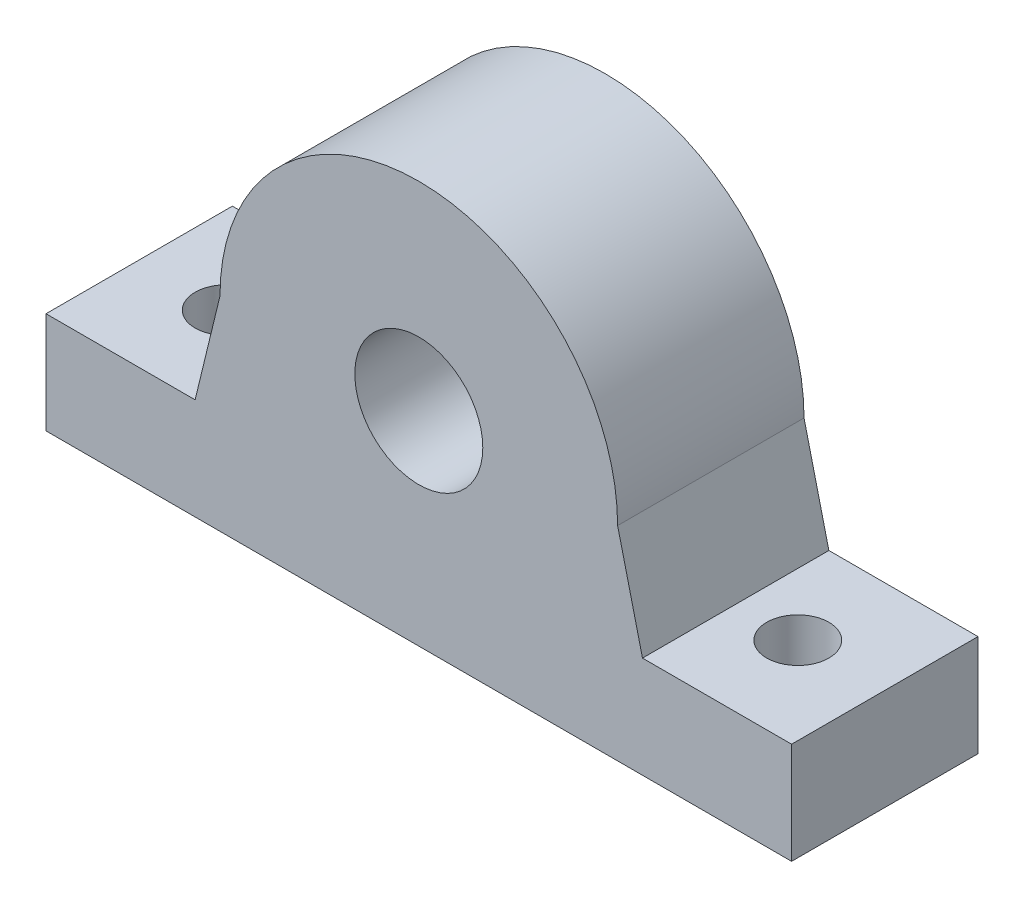
ISO-10303-21;
HEADER;
FILE_DESCRIPTION(('STEP AP214'),'2;1');
FILE_NAME('part.step','',(''),(''),'','','');
FILE_SCHEMA(('AUTOMOTIVE_DESIGN { 1 0 10303 214 1 1 1 1 }'));
ENDSEC;
DATA;
#1=APPLICATION_CONTEXT('core data for automotive mechanical design processes');
#2=APPLICATION_PROTOCOL_DEFINITION('international standard','automotive_design',2000,#1);
#3=PRODUCT_CONTEXT('',#1,'mechanical');
#4=PRODUCT('Part','Part','',(#3));
#5=PRODUCT_RELATED_PRODUCT_CATEGORY('part','',(#4));
#6=PRODUCT_DEFINITION_FORMATION('','',#4);
#7=PRODUCT_DEFINITION_CONTEXT('part definition',#1,'design');
#8=PRODUCT_DEFINITION('design','',#6,#7);
#9=PRODUCT_DEFINITION_SHAPE('','',#8);
#10=(LENGTH_UNIT() NAMED_UNIT(*) SI_UNIT(.MILLI.,.METRE.));
#11=(NAMED_UNIT(*) PLANE_ANGLE_UNIT() SI_UNIT($,.RADIAN.));
#12=(NAMED_UNIT(*) SI_UNIT($,.STERADIAN.) SOLID_ANGLE_UNIT());
#13=UNCERTAINTY_MEASURE_WITH_UNIT(LENGTH_MEASURE(1.E-05),#10,'distance_accuracy_value','');
#14=(GEOMETRIC_REPRESENTATION_CONTEXT(3) GLOBAL_UNCERTAINTY_ASSIGNED_CONTEXT((#13)) GLOBAL_UNIT_ASSIGNED_CONTEXT((#10,
#11,#12)) REPRESENTATION_CONTEXT('',''));
#15=CARTESIAN_POINT('',(0.,0.,0.));
#16=DIRECTION('',(0.,0.,1.));
#17=DIRECTION('',(1.,0.,0.));
#18=AXIS2_PLACEMENT_3D('',#15,#16,#17);
#19=CARTESIAN_POINT('',(0.,0.,15.));
#20=DIRECTION('',(0.,0.,-1.));
#21=DIRECTION('',(-1.,0.,0.));
#22=AXIS2_PLACEMENT_3D('',#19,#20,#21);
#23=PLANE('',#22);
#24=CARTESIAN_POINT('',(0.,0.,15.));
#25=DIRECTION('',(0.,0.,1.));
#26=DIRECTION('',(-1.,0.,0.));
#27=AXIS2_PLACEMENT_3D('',#24,#25,#26);
#28=CIRCLE('',#27,16.);
#29=CARTESIAN_POINT('',(16.,0.,15.));
#30=VERTEX_POINT('',#29);
#31=CARTESIAN_POINT('',(-16.,0.,15.));
#32=VERTEX_POINT('',#31);
#33=EDGE_CURVE('E150',#30,#32,#28,.T.);
#34=ORIENTED_EDGE('',*,*,#33,.T.);
#35=DIRECTION('',(-0.236019714905749,-0.971748266875639,0.));
#36=VECTOR('',#35,1.);
#37=CARTESIAN_POINT('',(-16.,0.,15.));
#38=LINE('',#37,#36);
#39=CARTESIAN_POINT('',(-18.,-8.23446691530569,15.));
#40=VERTEX_POINT('',#39);
#41=EDGE_CURVE('E98',#32,#40,#38,.T.);
#42=ORIENTED_EDGE('',*,*,#41,.T.);
#43=DIRECTION('',(-1.,0.,0.));
#44=VECTOR('',#43,1.);
#45=CARTESIAN_POINT('',(-18.,-8.23446691530569,15.));
#46=LINE('',#45,#44);
#47=CARTESIAN_POINT('',(-30.,-8.23446691530569,15.));
#48=VERTEX_POINT('',#47);
#49=EDGE_CURVE('E166',#40,#48,#46,.T.);
#50=ORIENTED_EDGE('',*,*,#49,.T.);
#51=DIRECTION('',(0.,-1.,0.));
#52=VECTOR('',#51,1.);
#53=CARTESIAN_POINT('',(-30.,-8.23446691530569,15.));
#54=LINE('',#53,#52);
#55=CARTESIAN_POINT('',(-30.,-16.4,15.));
#56=VERTEX_POINT('',#55);
#57=EDGE_CURVE('E178',#48,#56,#54,.T.);
#58=ORIENTED_EDGE('',*,*,#57,.T.);
#59=DIRECTION('',(1.,0.,0.));
#60=VECTOR('',#59,1.);
#61=CARTESIAN_POINT('',(-30.,-16.4,15.));
#62=LINE('',#61,#60);
#63=CARTESIAN_POINT('',(30.,-16.4,15.));
#64=VERTEX_POINT('',#63);
#65=EDGE_CURVE('E117',#56,#64,#62,.T.);
#66=ORIENTED_EDGE('',*,*,#65,.T.);
#67=DIRECTION('',(0.,1.,0.));
#68=VECTOR('',#67,1.);
#69=CARTESIAN_POINT('',(30.,-8.23446691530568,15.));
#70=LINE('',#69,#68);
#71=CARTESIAN_POINT('',(30.,-8.23446691530568,15.));
#72=VERTEX_POINT('',#71);
#73=EDGE_CURVE('E111',#64,#72,#70,.T.);
#74=ORIENTED_EDGE('',*,*,#73,.T.);
#75=DIRECTION('',(-1.,0.,0.));
#76=VECTOR('',#75,1.);
#77=CARTESIAN_POINT('',(18.,-8.23446691530568,15.));
#78=LINE('',#77,#76);
#79=CARTESIAN_POINT('',(18.,-8.23446691530568,15.));
#80=VERTEX_POINT('',#79);
#81=EDGE_CURVE('E115',#72,#80,#78,.T.);
#82=ORIENTED_EDGE('',*,*,#81,.T.);
#83=DIRECTION('',(-0.23601971490575,0.971748266875639,0.));
#84=VECTOR('',#83,1.);
#85=CARTESIAN_POINT('',(16.,0.,15.));
#86=LINE('',#85,#84);
#87=EDGE_CURVE('E55',#80,#30,#86,.T.);
#88=ORIENTED_EDGE('',*,*,#87,.T.);
#89=EDGE_LOOP('',(#34,#42,#50,#58,#66,#74,#82,#88));
#90=FACE_BOUND('',#89,.T.);
#91=CARTESIAN_POINT('',(0.,0.,15.));
#92=DIRECTION('',(0.,0.,1.));
#93=DIRECTION('',(1.,0.,0.));
#94=AXIS2_PLACEMENT_3D('',#91,#92,#93);
#95=CIRCLE('',#94,5.15);
#96=CARTESIAN_POINT('',(5.15,0.,15.));
#97=VERTEX_POINT('',#96);
#98=EDGE_CURVE('E139',#97,#97,#95,.T.);
#99=ORIENTED_EDGE('',*,*,#98,.F.);
#100=EDGE_LOOP('',(#99));
#101=FACE_BOUND('',#100,.T.);
#102=ADVANCED_FACE('F37',(#90,#101),#23,.F.);
#103=CARTESIAN_POINT('',(0.,0.,0.));
#104=DIRECTION('',(0.,0.,-1.));
#105=DIRECTION('',(-1.,0.,0.));
#106=AXIS2_PLACEMENT_3D('',#103,#104,#105);
#107=PLANE('',#106);
#108=CARTESIAN_POINT('',(0.,0.,0.));
#109=DIRECTION('',(0.,0.,1.));
#110=DIRECTION('',(1.,0.,0.));
#111=AXIS2_PLACEMENT_3D('',#108,#109,#110);
#112=CIRCLE('',#111,11.);
#113=CARTESIAN_POINT('',(11.,0.,0.));
#114=VERTEX_POINT('',#113);
#115=EDGE_CURVE('E186',#114,#114,#112,.T.);
#116=ORIENTED_EDGE('',*,*,#115,.T.);
#117=EDGE_LOOP('',(#116));
#118=FACE_BOUND('',#117,.T.);
#119=CARTESIAN_POINT('',(0.,0.,0.));
#120=DIRECTION('',(0.,0.,1.));
#121=DIRECTION('',(-1.,0.,0.));
#122=AXIS2_PLACEMENT_3D('',#119,#120,#121);
#123=CIRCLE('',#122,16.);
#124=CARTESIAN_POINT('',(16.,0.,0.));
#125=VERTEX_POINT('',#124);
#126=CARTESIAN_POINT('',(-16.,0.,0.));
#127=VERTEX_POINT('',#126);
#128=EDGE_CURVE('E135',#125,#127,#123,.T.);
#129=ORIENTED_EDGE('',*,*,#128,.F.);
#130=DIRECTION('',(-0.23601971490575,0.971748266875639,0.));
#131=VECTOR('',#130,1.);
#132=CARTESIAN_POINT('',(16.,0.,0.));
#133=LINE('',#132,#131);
#134=CARTESIAN_POINT('',(18.,-8.23446691530568,0.));
#135=VERTEX_POINT('',#134);
#136=EDGE_CURVE('E90',#135,#125,#133,.T.);
#137=ORIENTED_EDGE('',*,*,#136,.F.);
#138=DIRECTION('',(-1.,0.,0.));
#139=VECTOR('',#138,1.);
#140=CARTESIAN_POINT('',(18.,-8.23446691530568,0.));
#141=LINE('',#140,#139);
#142=CARTESIAN_POINT('',(30.,-8.23446691530568,0.));
#143=VERTEX_POINT('',#142);
#144=EDGE_CURVE('E84',#143,#135,#141,.T.);
#145=ORIENTED_EDGE('',*,*,#144,.F.);
#146=DIRECTION('',(0.,1.,0.));
#147=VECTOR('',#146,1.);
#148=CARTESIAN_POINT('',(30.,-8.23446691530568,0.));
#149=LINE('',#148,#147);
#150=CARTESIAN_POINT('',(30.,-16.4,0.));
#151=VERTEX_POINT('',#150);
#152=EDGE_CURVE('E125',#151,#143,#149,.T.);
#153=ORIENTED_EDGE('',*,*,#152,.F.);
#154=DIRECTION('',(1.,0.,0.));
#155=VECTOR('',#154,1.);
#156=CARTESIAN_POINT('',(-30.,-16.4,0.));
#157=LINE('',#156,#155);
#158=CARTESIAN_POINT('',(-30.,-16.4,0.));
#159=VERTEX_POINT('',#158);
#160=EDGE_CURVE('E145',#159,#151,#157,.T.);
#161=ORIENTED_EDGE('',*,*,#160,.F.);
#162=DIRECTION('',(0.,-1.,0.));
#163=VECTOR('',#162,1.);
#164=CARTESIAN_POINT('',(-30.,-8.23446691530569,0.));
#165=LINE('',#164,#163);
#166=CARTESIAN_POINT('',(-30.,-8.23446691530569,0.));
#167=VERTEX_POINT('',#166);
#168=EDGE_CURVE('E143',#167,#159,#165,.T.);
#169=ORIENTED_EDGE('',*,*,#168,.F.);
#170=DIRECTION('',(-1.,0.,0.));
#171=VECTOR('',#170,1.);
#172=CARTESIAN_POINT('',(-18.,-8.23446691530569,0.));
#173=LINE('',#172,#171);
#174=CARTESIAN_POINT('',(-18.,-8.23446691530569,0.));
#175=VERTEX_POINT('',#174);
#176=EDGE_CURVE('E141',#175,#167,#173,.T.);
#177=ORIENTED_EDGE('',*,*,#176,.F.);
#178=DIRECTION('',(-0.236019714905749,-0.971748266875639,0.));
#179=VECTOR('',#178,1.);
#180=CARTESIAN_POINT('',(-16.,0.,0.));
#181=LINE('',#180,#179);
#182=EDGE_CURVE('E138',#127,#175,#181,.T.);
#183=ORIENTED_EDGE('',*,*,#182,.F.);
#184=EDGE_LOOP('',(#129,#137,#145,#153,#161,#169,#177,#183));
#185=FACE_BOUND('',#184,.T.);
#186=ADVANCED_FACE('F170',(#118,#185),#107,.T.);
#187=CARTESIAN_POINT('',(0.,0.,15.));
#188=DIRECTION('',(0.,0.,-1.));
#189=DIRECTION('',(-1.,0.,0.));
#190=AXIS2_PLACEMENT_3D('',#187,#188,#189);
#191=CYLINDRICAL_SURFACE('',#190,16.);
#192=ORIENTED_EDGE('',*,*,#128,.T.);
#193=DIRECTION('',(0.,0.,-1.));
#194=VECTOR('',#193,1.);
#195=CARTESIAN_POINT('',(-16.,0.,15.));
#196=LINE('',#195,#194);
#197=EDGE_CURVE('E11',#32,#127,#196,.T.);
#198=ORIENTED_EDGE('',*,*,#197,.F.);
#199=ORIENTED_EDGE('',*,*,#33,.F.);
#200=DIRECTION('',(0.,0.,-1.));
#201=VECTOR('',#200,1.);
#202=CARTESIAN_POINT('',(16.,0.,15.));
#203=LINE('',#202,#201);
#204=EDGE_CURVE('E131',#30,#125,#203,.T.);
#205=ORIENTED_EDGE('',*,*,#204,.T.);
#206=EDGE_LOOP('',(#192,#198,#199,#205));
#207=FACE_BOUND('',#206,.T.);
#208=ADVANCED_FACE('F39',(#207),#191,.T.);
#209=CARTESIAN_POINT('',(-16.,0.,15.));
#210=DIRECTION('',(0.971748266875639,-0.236019714905749,0.));
#211=DIRECTION('',(0.236019714905749,0.971748266875639,0.));
#212=AXIS2_PLACEMENT_3D('',#209,#210,#211);
#213=PLANE('',#212);
#214=ORIENTED_EDGE('',*,*,#182,.T.);
#215=DIRECTION('',(0.,0.,-1.));
#216=VECTOR('',#215,1.);
#217=CARTESIAN_POINT('',(-18.,-8.23446691530569,15.));
#218=LINE('',#217,#216);
#219=EDGE_CURVE('E47',#40,#175,#218,.T.);
#220=ORIENTED_EDGE('',*,*,#219,.F.);
#221=ORIENTED_EDGE('',*,*,#41,.F.);
#222=ORIENTED_EDGE('',*,*,#197,.T.);
#223=EDGE_LOOP('',(#214,#220,#221,#222));
#224=FACE_BOUND('',#223,.T.);
#225=ADVANCED_FACE('F215',(#224),#213,.F.);
#226=CARTESIAN_POINT('',(-18.,-8.23446691530569,15.));
#227=DIRECTION('',(0.,-1.,0.));
#228=DIRECTION('',(0.,0.,-1.));
#229=AXIS2_PLACEMENT_3D('',#226,#227,#228);
#230=PLANE('',#229);
#231=CARTESIAN_POINT('',(-23.,-8.23446691530569,7.5));
#232=DIRECTION('',(0.,1.,0.));
#233=DIRECTION('',(-1.,0.,0.));
#234=AXIS2_PLACEMENT_3D('',#231,#232,#233);
#235=CIRCLE('',#234,2.5);
#236=CARTESIAN_POINT('',(-25.5,-8.23446691530569,7.5));
#237=VERTEX_POINT('',#236);
#238=EDGE_CURVE('E199',#237,#237,#235,.T.);
#239=ORIENTED_EDGE('',*,*,#238,.F.);
#240=EDGE_LOOP('',(#239));
#241=FACE_BOUND('',#240,.T.);
#242=ORIENTED_EDGE('',*,*,#176,.T.);
#243=DIRECTION('',(0.,0.,-1.));
#244=VECTOR('',#243,1.);
#245=CARTESIAN_POINT('',(-30.,-8.23446691530569,15.));
#246=LINE('',#245,#244);
#247=EDGE_CURVE('E157',#48,#167,#246,.T.);
#248=ORIENTED_EDGE('',*,*,#247,.F.);
#249=ORIENTED_EDGE('',*,*,#49,.F.);
#250=ORIENTED_EDGE('',*,*,#219,.T.);
#251=EDGE_LOOP('',(#242,#248,#249,#250));
#252=FACE_BOUND('',#251,.T.);
#253=ADVANCED_FACE('F164',(#241,#252),#230,.F.);
#254=CARTESIAN_POINT('',(-30.,-8.23446691530569,15.));
#255=DIRECTION('',(1.,0.,0.));
#256=DIRECTION('',(0.,1.,0.));
#257=AXIS2_PLACEMENT_3D('',#254,#255,#256);
#258=PLANE('',#257);
#259=ORIENTED_EDGE('',*,*,#168,.T.);
#260=DIRECTION('',(0.,0.,-1.));
#261=VECTOR('',#260,1.);
#262=CARTESIAN_POINT('',(-30.,-16.4,15.));
#263=LINE('',#262,#261);
#264=EDGE_CURVE('E154',#56,#159,#263,.T.);
#265=ORIENTED_EDGE('',*,*,#264,.F.);
#266=ORIENTED_EDGE('',*,*,#57,.F.);
#267=ORIENTED_EDGE('',*,*,#247,.T.);
#268=EDGE_LOOP('',(#259,#265,#266,#267));
#269=FACE_BOUND('',#268,.T.);
#270=ADVANCED_FACE('F174',(#269),#258,.F.);
#271=CARTESIAN_POINT('',(-30.,-16.4,15.));
#272=DIRECTION('',(0.,1.,0.));
#273=DIRECTION('',(-1.,0.,0.));
#274=AXIS2_PLACEMENT_3D('',#271,#272,#273);
#275=PLANE('',#274);
#276=CARTESIAN_POINT('',(-23.,-16.4,7.5));
#277=DIRECTION('',(0.,1.,0.));
#278=DIRECTION('',(-1.,0.,0.));
#279=AXIS2_PLACEMENT_3D('',#276,#277,#278);
#280=CIRCLE('',#279,2.5);
#281=CARTESIAN_POINT('',(-25.5,-16.4,7.5));
#282=VERTEX_POINT('',#281);
#283=EDGE_CURVE('E190',#282,#282,#280,.T.);
#284=ORIENTED_EDGE('',*,*,#283,.T.);
#285=EDGE_LOOP('',(#284));
#286=FACE_BOUND('',#285,.T.);
#287=CARTESIAN_POINT('',(23.,-16.4,7.49999999999999));
#288=DIRECTION('',(0.,1.,0.));
#289=DIRECTION('',(1.,0.,0.));
#290=AXIS2_PLACEMENT_3D('',#287,#288,#289);
#291=CIRCLE('',#290,2.5);
#292=CARTESIAN_POINT('',(25.5,-16.4,7.49999999999999));
#293=VERTEX_POINT('',#292);
#294=EDGE_CURVE('E196',#293,#293,#291,.T.);
#295=ORIENTED_EDGE('',*,*,#294,.T.);
#296=EDGE_LOOP('',(#295));
#297=FACE_BOUND('',#296,.T.);
#298=ORIENTED_EDGE('',*,*,#160,.T.);
#299=DIRECTION('',(0.,0.,-1.));
#300=VECTOR('',#299,1.);
#301=CARTESIAN_POINT('',(30.,-16.4,15.));
#302=LINE('',#301,#300);
#303=EDGE_CURVE('E126',#64,#151,#302,.T.);
#304=ORIENTED_EDGE('',*,*,#303,.F.);
#305=ORIENTED_EDGE('',*,*,#65,.F.);
#306=ORIENTED_EDGE('',*,*,#264,.T.);
#307=EDGE_LOOP('',(#298,#304,#305,#306));
#308=FACE_BOUND('',#307,.T.);
#309=ADVANCED_FACE('F177',(#286,#297,#308),#275,.F.);
#310=CARTESIAN_POINT('',(30.,-8.23446691530568,15.));
#311=DIRECTION('',(-1.,0.,0.));
#312=DIRECTION('',(0.,-1.,0.));
#313=AXIS2_PLACEMENT_3D('',#310,#311,#312);
#314=PLANE('',#313);
#315=ORIENTED_EDGE('',*,*,#152,.T.);
#316=DIRECTION('',(0.,0.,-1.));
#317=VECTOR('',#316,1.);
#318=CARTESIAN_POINT('',(30.,-8.23446691530568,15.));
#319=LINE('',#318,#317);
#320=EDGE_CURVE('E122',#72,#143,#319,.T.);
#321=ORIENTED_EDGE('',*,*,#320,.F.);
#322=ORIENTED_EDGE('',*,*,#73,.F.);
#323=ORIENTED_EDGE('',*,*,#303,.T.);
#324=EDGE_LOOP('',(#315,#321,#322,#323));
#325=FACE_BOUND('',#324,.T.);
#326=ADVANCED_FACE('F123',(#325),#314,.F.);
#327=CARTESIAN_POINT('',(18.,-8.23446691530568,15.));
#328=DIRECTION('',(0.,-1.,0.));
#329=DIRECTION('',(1.,0.,0.));
#330=AXIS2_PLACEMENT_3D('',#327,#328,#329);
#331=PLANE('',#330);
#332=CARTESIAN_POINT('',(23.,-8.23446691530568,7.49999999999999));
#333=DIRECTION('',(0.,1.,0.));
#334=DIRECTION('',(1.,0.,0.));
#335=AXIS2_PLACEMENT_3D('',#332,#333,#334);
#336=CIRCLE('',#335,2.5);
#337=CARTESIAN_POINT('',(25.5,-8.23446691530568,7.49999999999999));
#338=VERTEX_POINT('',#337);
#339=EDGE_CURVE('E193',#338,#338,#336,.T.);
#340=ORIENTED_EDGE('',*,*,#339,.F.);
#341=EDGE_LOOP('',(#340));
#342=FACE_BOUND('',#341,.T.);
#343=ORIENTED_EDGE('',*,*,#144,.T.);
#344=DIRECTION('',(0.,0.,-1.));
#345=VECTOR('',#344,1.);
#346=CARTESIAN_POINT('',(18.,-8.23446691530568,15.));
#347=LINE('',#346,#345);
#348=EDGE_CURVE('E127',#80,#135,#347,.T.);
#349=ORIENTED_EDGE('',*,*,#348,.F.);
#350=ORIENTED_EDGE('',*,*,#81,.F.);
#351=ORIENTED_EDGE('',*,*,#320,.T.);
#352=EDGE_LOOP('',(#343,#349,#350,#351));
#353=FACE_BOUND('',#352,.T.);
#354=ADVANCED_FACE('F129',(#342,#353),#331,.F.);
#355=CARTESIAN_POINT('',(16.,0.,15.));
#356=DIRECTION('',(-0.971748266875639,-0.23601971490575,0.));
#357=DIRECTION('',(0.23601971490575,-0.971748266875639,0.));
#358=AXIS2_PLACEMENT_3D('',#355,#356,#357);
#359=PLANE('',#358);
#360=ORIENTED_EDGE('',*,*,#136,.T.);
#361=ORIENTED_EDGE('',*,*,#204,.F.);
#362=ORIENTED_EDGE('',*,*,#87,.F.);
#363=ORIENTED_EDGE('',*,*,#348,.T.);
#364=EDGE_LOOP('',(#360,#361,#362,#363));
#365=FACE_BOUND('',#364,.T.);
#366=ADVANCED_FACE('F233',(#365),#359,.F.);
#367=CARTESIAN_POINT('',(0.,0.,15.));
#368=DIRECTION('',(0.,0.,-1.));
#369=DIRECTION('',(-1.,0.,0.));
#370=AXIS2_PLACEMENT_3D('',#367,#368,#369);
#371=CYLINDRICAL_SURFACE('',#370,5.15);
#372=CARTESIAN_POINT('',(0.,0.,4.));
#373=DIRECTION('',(0.,0.,1.));
#374=DIRECTION('',(1.,0.,0.));
#375=AXIS2_PLACEMENT_3D('',#372,#373,#374);
#376=CIRCLE('',#375,5.15);
#377=CARTESIAN_POINT('',(5.15,0.,4.));
#378=VERTEX_POINT('',#377);
#379=EDGE_CURVE('E41',#378,#378,#376,.T.);
#380=ORIENTED_EDGE('',*,*,#379,.F.);
#381=EDGE_LOOP('',(#380));
#382=FACE_BOUND('',#381,.T.);
#383=ORIENTED_EDGE('',*,*,#98,.T.);
#384=EDGE_LOOP('',(#383));
#385=FACE_BOUND('',#384,.T.);
#386=ADVANCED_FACE('F230',(#382,#385),#371,.F.);
#387=CARTESIAN_POINT('',(0.,0.,4.));
#388=DIRECTION('',(0.,0.,-1.));
#389=DIRECTION('',(-1.,0.,0.));
#390=AXIS2_PLACEMENT_3D('',#387,#388,#389);
#391=CYLINDRICAL_SURFACE('',#390,11.);
#392=CARTESIAN_POINT('',(0.,0.,4.));
#393=DIRECTION('',(0.,0.,1.));
#394=DIRECTION('',(1.,0.,0.));
#395=AXIS2_PLACEMENT_3D('',#392,#393,#394);
#396=CIRCLE('',#395,11.);
#397=CARTESIAN_POINT('',(11.,0.,4.));
#398=VERTEX_POINT('',#397);
#399=EDGE_CURVE('E189',#398,#398,#396,.T.);
#400=ORIENTED_EDGE('',*,*,#399,.T.);
#401=EDGE_LOOP('',(#400));
#402=FACE_BOUND('',#401,.T.);
#403=ORIENTED_EDGE('',*,*,#115,.F.);
#404=EDGE_LOOP('',(#403));
#405=FACE_BOUND('',#404,.T.);
#406=ADVANCED_FACE('F266',(#402,#405),#391,.F.);
#407=CARTESIAN_POINT('',(0.,0.,4.));
#408=DIRECTION('',(0.,0.,1.));
#409=DIRECTION('',(1.,0.,0.));
#410=AXIS2_PLACEMENT_3D('',#407,#408,#409);
#411=PLANE('',#410);
#412=ORIENTED_EDGE('',*,*,#379,.T.);
#413=EDGE_LOOP('',(#412));
#414=FACE_BOUND('',#413,.T.);
#415=ORIENTED_EDGE('',*,*,#399,.F.);
#416=EDGE_LOOP('',(#415));
#417=FACE_BOUND('',#416,.T.);
#418=ADVANCED_FACE('F273',(#414,#417),#411,.F.);
#419=CARTESIAN_POINT('',(23.,-16.4,7.49999999999999));
#420=DIRECTION('',(0.,1.,0.));
#421=DIRECTION('',(-1.,0.,0.));
#422=AXIS2_PLACEMENT_3D('',#419,#420,#421);
#423=CYLINDRICAL_SURFACE('',#422,2.5);
#424=ORIENTED_EDGE('',*,*,#294,.F.);
#425=EDGE_LOOP('',(#424));
#426=FACE_BOUND('',#425,.T.);
#427=ORIENTED_EDGE('',*,*,#339,.T.);
#428=EDGE_LOOP('',(#427));
#429=FACE_BOUND('',#428,.T.);
#430=ADVANCED_FACE('F210',(#426,#429),#423,.F.);
#431=CARTESIAN_POINT('',(-23.,-16.4,7.5));
#432=DIRECTION('',(0.,1.,0.));
#433=DIRECTION('',(-1.,0.,0.));
#434=AXIS2_PLACEMENT_3D('',#431,#432,#433);
#435=CYLINDRICAL_SURFACE('',#434,2.5);
#436=ORIENTED_EDGE('',*,*,#283,.F.);
#437=EDGE_LOOP('',(#436));
#438=FACE_BOUND('',#437,.T.);
#439=ORIENTED_EDGE('',*,*,#238,.T.);
#440=EDGE_LOOP('',(#439));
#441=FACE_BOUND('',#440,.T.);
#442=ADVANCED_FACE('F207',(#438,#441),#435,.F.);
#443=CLOSED_SHELL('',(#102,#186,#208,#225,#253,#270,#309,#326,#354,#366,#386,#406,#418,#430,#442));
#444=MANIFOLD_SOLID_BREP('B2',#443);
#445=ADVANCED_BREP_SHAPE_REPRESENTATION('',(#18,#444),#14);
#446=SHAPE_DEFINITION_REPRESENTATION(#9,#445);
ENDSEC;
END-ISO-10303-21;
